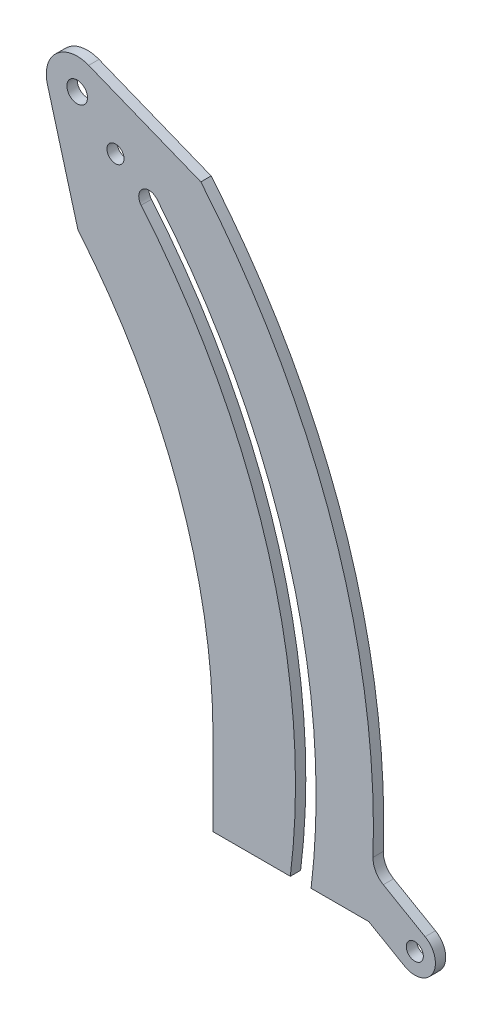
ISO-10303-21;
HEADER;
FILE_DESCRIPTION(('STEP AP214'),'2;1');
FILE_NAME('part.step','',(''),(''),'','','');
FILE_SCHEMA(('AUTOMOTIVE_DESIGN { 1 0 10303 214 1 1 1 1 }'));
ENDSEC;
DATA;
#1=APPLICATION_CONTEXT('core data for automotive mechanical design processes');
#2=APPLICATION_PROTOCOL_DEFINITION('international standard','automotive_design',2000,#1);
#3=PRODUCT_CONTEXT('',#1,'mechanical');
#4=PRODUCT('Part','Part','',(#3));
#5=PRODUCT_RELATED_PRODUCT_CATEGORY('part','',(#4));
#6=PRODUCT_DEFINITION_FORMATION('','',#4);
#7=PRODUCT_DEFINITION_CONTEXT('part definition',#1,'design');
#8=PRODUCT_DEFINITION('design','',#6,#7);
#9=PRODUCT_DEFINITION_SHAPE('','',#8);
#10=(LENGTH_UNIT() NAMED_UNIT(*) SI_UNIT(.MILLI.,.METRE.));
#11=(NAMED_UNIT(*) PLANE_ANGLE_UNIT() SI_UNIT($,.RADIAN.));
#12=(NAMED_UNIT(*) SI_UNIT($,.STERADIAN.) SOLID_ANGLE_UNIT());
#13=UNCERTAINTY_MEASURE_WITH_UNIT(LENGTH_MEASURE(1.E-05),#10,'distance_accuracy_value','');
#14=(GEOMETRIC_REPRESENTATION_CONTEXT(3) GLOBAL_UNCERTAINTY_ASSIGNED_CONTEXT((#13)) GLOBAL_UNIT_ASSIGNED_CONTEXT((#10,
#11,#12)) REPRESENTATION_CONTEXT('',''));
#15=CARTESIAN_POINT('',(0.,0.,0.));
#16=DIRECTION('',(0.,0.,1.));
#17=DIRECTION('',(1.,0.,0.));
#18=AXIS2_PLACEMENT_3D('',#15,#16,#17);
#19=CARTESIAN_POINT('',(0.,0.,3.175));
#20=DIRECTION('',(0.,0.,-1.));
#21=DIRECTION('',(-1.,0.,0.));
#22=AXIS2_PLACEMENT_3D('',#19,#20,#21);
#23=CYLINDRICAL_SURFACE('',#22,203.2);
#24=CARTESIAN_POINT('',(0.,0.,0.));
#25=DIRECTION('',(0.,0.,1.));
#26=DIRECTION('',(1.,0.,0.));
#27=AXIS2_PLACEMENT_3D('',#24,#25,#26);
#28=CIRCLE('',#27,203.2);
#29=CARTESIAN_POINT('',(201.606249903122,-25.4000000000001,0.));
#30=VERTEX_POINT('',#29);
#31=CARTESIAN_POINT('',(155.660230841776,130.614442288305,0.));
#32=VERTEX_POINT('',#31);
#33=EDGE_CURVE('E187',#30,#32,#28,.T.);
#34=ORIENTED_EDGE('',*,*,#33,.T.);
#35=DIRECTION('',(0.,0.,-1.));
#36=VECTOR('',#35,1.);
#37=CARTESIAN_POINT('',(155.660230841776,130.614442288305,3.175));
#38=LINE('',#37,#36);
#39=CARTESIAN_POINT('',(155.660230841776,130.614442288305,3.175));
#40=VERTEX_POINT('',#39);
#41=EDGE_CURVE('E259',#40,#32,#38,.T.);
#42=ORIENTED_EDGE('',*,*,#41,.F.);
#43=CARTESIAN_POINT('',(0.,0.,3.175));
#44=DIRECTION('',(0.,0.,1.));
#45=DIRECTION('',(1.,0.,0.));
#46=AXIS2_PLACEMENT_3D('',#43,#44,#45);
#47=CIRCLE('',#46,203.2);
#48=CARTESIAN_POINT('',(201.606249903122,-25.4000000000001,3.175));
#49=VERTEX_POINT('',#48);
#50=EDGE_CURVE('E190',#49,#40,#47,.T.);
#51=ORIENTED_EDGE('',*,*,#50,.F.);
#52=DIRECTION('',(0.,0.,-1.));
#53=VECTOR('',#52,1.);
#54=CARTESIAN_POINT('',(201.606249903122,-25.4000000000001,3.175));
#55=LINE('',#54,#53);
#56=EDGE_CURVE('E212',#49,#30,#55,.T.);
#57=ORIENTED_EDGE('',*,*,#56,.T.);
#58=EDGE_LOOP('',(#34,#42,#51,#57));
#59=FACE_BOUND('',#58,.T.);
#60=ADVANCED_FACE('F33',(#59),#23,.T.);
#61=CARTESIAN_POINT('',(0.,0.,3.175));
#62=DIRECTION('',(0.,0.,-1.));
#63=DIRECTION('',(-1.,0.,0.));
#64=AXIS2_PLACEMENT_3D('',#61,#62,#63);
#65=CYLINDRICAL_SURFACE('',#64,209.55);
#66=CARTESIAN_POINT('',(0.,0.,0.));
#67=DIRECTION('',(0.,0.,-1.));
#68=DIRECTION('',(1.,0.,0.));
#69=AXIS2_PLACEMENT_3D('',#66,#67,#68);
#70=CIRCLE('',#69,209.55);
#71=CARTESIAN_POINT('',(160.524613055582,134.696143609815,0.));
#72=VERTEX_POINT('',#71);
#73=CARTESIAN_POINT('',(208.004909797822,-25.4,0.));
#74=VERTEX_POINT('',#73);
#75=EDGE_CURVE('E215',#72,#74,#70,.T.);
#76=ORIENTED_EDGE('',*,*,#75,.T.);
#77=DIRECTION('',(0.,0.,-1.));
#78=VECTOR('',#77,1.);
#79=CARTESIAN_POINT('',(208.004909797822,-25.4,3.175));
#80=LINE('',#79,#78);
#81=CARTESIAN_POINT('',(208.004909797822,-25.4,3.175));
#82=VERTEX_POINT('',#81);
#83=EDGE_CURVE('E253',#82,#74,#80,.T.);
#84=ORIENTED_EDGE('',*,*,#83,.F.);
#85=CARTESIAN_POINT('',(0.,0.,3.175));
#86=DIRECTION('',(0.,0.,-1.));
#87=DIRECTION('',(1.,0.,0.));
#88=AXIS2_PLACEMENT_3D('',#85,#86,#87);
#89=CIRCLE('',#88,209.55);
#90=CARTESIAN_POINT('',(160.524613055582,134.696143609815,3.175));
#91=VERTEX_POINT('',#90);
#92=EDGE_CURVE('E193',#91,#82,#89,.T.);
#93=ORIENTED_EDGE('',*,*,#92,.F.);
#94=DIRECTION('',(0.,0.,-1.));
#95=VECTOR('',#94,1.);
#96=CARTESIAN_POINT('',(160.524613055582,134.696143609815,3.175));
#97=LINE('',#96,#95);
#98=EDGE_CURVE('E256',#91,#72,#97,.T.);
#99=ORIENTED_EDGE('',*,*,#98,.T.);
#100=EDGE_LOOP('',(#76,#84,#93,#99));
#101=FACE_BOUND('',#100,.T.);
#102=ADVANCED_FACE('F280',(#101),#65,.F.);
#103=CARTESIAN_POINT('',(208.004909797822,-25.4,3.175));
#104=DIRECTION('',(0.,1.,0.));
#105=DIRECTION('',(-1.,0.,0.));
#106=AXIS2_PLACEMENT_3D('',#103,#104,#105);
#107=PLANE('',#106);
#108=DIRECTION('',(1.,0.,0.));
#109=VECTOR('',#108,1.);
#110=CARTESIAN_POINT('',(208.004909797822,-25.4,0.));
#111=LINE('',#110,#109);
#112=CARTESIAN_POINT('',(225.775729430778,-25.4000000000001,0.));
#113=VERTEX_POINT('',#112);
#114=EDGE_CURVE('E217',#74,#113,#111,.T.);
#115=ORIENTED_EDGE('',*,*,#114,.T.);
#116=DIRECTION('',(0.,0.,-1.));
#117=VECTOR('',#116,1.);
#118=CARTESIAN_POINT('',(225.775729430778,-25.4000000000001,3.175));
#119=LINE('',#118,#117);
#120=CARTESIAN_POINT('',(225.775729430778,-25.4000000000001,3.175));
#121=VERTEX_POINT('',#120);
#122=EDGE_CURVE('E164',#121,#113,#119,.T.);
#123=ORIENTED_EDGE('',*,*,#122,.F.);
#124=DIRECTION('',(1.,0.,0.));
#125=VECTOR('',#124,1.);
#126=CARTESIAN_POINT('',(208.004909797822,-25.4,3.175));
#127=LINE('',#126,#125);
#128=EDGE_CURVE('E196',#82,#121,#127,.T.);
#129=ORIENTED_EDGE('',*,*,#128,.F.);
#130=ORIENTED_EDGE('',*,*,#83,.T.);
#131=EDGE_LOOP('',(#115,#123,#129,#130));
#132=FACE_BOUND('',#131,.T.);
#133=ADVANCED_FACE('F277',(#132),#107,.F.);
#134=CARTESIAN_POINT('',(0.,0.,3.175));
#135=DIRECTION('',(0.,0.,-1.));
#136=DIRECTION('',(-1.,0.,0.));
#137=AXIS2_PLACEMENT_3D('',#134,#135,#136);
#138=CYLINDRICAL_SURFACE('',#137,227.2);
#139=CARTESIAN_POINT('',(0.,0.,3.175));
#140=DIRECTION('',(0.,0.,1.));
#141=DIRECTION('',(1.,0.,0.));
#142=AXIS2_PLACEMENT_3D('',#139,#140,#141);
#143=CIRCLE('',#142,227.2);
#144=CARTESIAN_POINT('',(227.072738032477,-7.60339676948811,3.175));
#145=VERTEX_POINT('',#144);
#146=CARTESIAN_POINT('',(174.045297476632,146.041344920782,3.175));
#147=VERTEX_POINT('',#146);
#148=EDGE_CURVE('E198',#145,#147,#143,.T.);
#149=ORIENTED_EDGE('',*,*,#148,.F.);
#150=DIRECTION('',(0.,0.,-1.));
#151=VECTOR('',#150,1.);
#152=CARTESIAN_POINT('',(227.072738032477,-7.60339676948811,3.175));
#153=LINE('',#152,#151);
#154=CARTESIAN_POINT('',(227.072738032477,-7.60339676948811,0.));
#155=VERTEX_POINT('',#154);
#156=EDGE_CURVE('E48',#145,#155,#153,.T.);
#157=ORIENTED_EDGE('',*,*,#156,.T.);
#158=CARTESIAN_POINT('',(0.,0.,0.));
#159=DIRECTION('',(0.,0.,1.));
#160=DIRECTION('',(1.,0.,0.));
#161=AXIS2_PLACEMENT_3D('',#158,#159,#160);
#162=CIRCLE('',#161,227.2);
#163=CARTESIAN_POINT('',(174.045297476632,146.041344920782,0.));
#164=VERTEX_POINT('',#163);
#165=EDGE_CURVE('E219',#155,#164,#162,.T.);
#166=ORIENTED_EDGE('',*,*,#165,.T.);
#167=DIRECTION('',(0.,0.,-1.));
#168=VECTOR('',#167,1.);
#169=CARTESIAN_POINT('',(174.045297476632,146.041344920782,3.175));
#170=LINE('',#169,#168);
#171=EDGE_CURVE('E249',#147,#164,#170,.T.);
#172=ORIENTED_EDGE('',*,*,#171,.F.);
#173=EDGE_LOOP('',(#149,#157,#166,#172));
#174=FACE_BOUND('',#173,.T.);
#175=ADVANCED_FACE('F336',(#174),#138,.T.);
#176=CARTESIAN_POINT('',(174.045297476632,146.041344920782,3.175));
#177=DIRECTION('',(-0.371233996494278,-0.92853934749524,0.));
#178=DIRECTION('',(0.92853934749524,-0.371233996494278,0.));
#179=AXIS2_PLACEMENT_3D('',#176,#177,#178);
#180=PLANE('',#179);
#181=DIRECTION('',(-0.92853934749524,0.371233996494278,0.));
#182=VECTOR('',#181,1.);
#183=CARTESIAN_POINT('',(174.045297476632,146.041344920782,0.));
#184=LINE('',#183,#182);
#185=CARTESIAN_POINT('',(139.503343028728,159.851365821899,0.));
#186=VERTEX_POINT('',#185);
#187=EDGE_CURVE('E221',#164,#186,#184,.T.);
#188=ORIENTED_EDGE('',*,*,#187,.T.);
#189=DIRECTION('',(0.,0.,-1.));
#190=VECTOR('',#189,1.);
#191=CARTESIAN_POINT('',(139.503343028728,159.851365821899,3.175));
#192=LINE('',#191,#190);
#193=CARTESIAN_POINT('',(139.503343028728,159.851365821899,3.175));
#194=VERTEX_POINT('',#193);
#195=EDGE_CURVE('E246',#194,#186,#192,.T.);
#196=ORIENTED_EDGE('',*,*,#195,.F.);
#197=DIRECTION('',(-0.92853934749524,0.371233996494278,0.));
#198=VECTOR('',#197,1.);
#199=CARTESIAN_POINT('',(174.045297476632,146.041344920782,3.175));
#200=LINE('',#199,#198);
#201=EDGE_CURVE('E200',#147,#194,#200,.T.);
#202=ORIENTED_EDGE('',*,*,#201,.F.);
#203=ORIENTED_EDGE('',*,*,#171,.T.);
#204=EDGE_LOOP('',(#188,#196,#202,#203));
#205=FACE_BOUND('',#204,.T.);
#206=ADVANCED_FACE('F315',(#205),#180,.F.);
#207=CARTESIAN_POINT('',(135.96733921212,151.007028537007,3.175));
#208=DIRECTION('',(0.,0.,-1.));
#209=DIRECTION('',(-1.,0.,0.));
#210=AXIS2_PLACEMENT_3D('',#207,#208,#209);
#211=CYLINDRICAL_SURFACE('',#210,9.52499999999994);
#212=CARTESIAN_POINT('',(135.96733921212,151.007028537007,0.));
#213=DIRECTION('',(0.,0.,1.));
#214=DIRECTION('',(1.,0.,0.));
#215=AXIS2_PLACEMENT_3D('',#212,#213,#214);
#216=CIRCLE('',#215,9.52499999999994);
#217=CARTESIAN_POINT('',(126.784391337904,148.477385609746,0.));
#218=VERTEX_POINT('',#217);
#219=EDGE_CURVE('E223',#186,#218,#216,.T.);
#220=ORIENTED_EDGE('',*,*,#219,.T.);
#221=DIRECTION('',(0.,0.,-1.));
#222=VECTOR('',#221,1.);
#223=CARTESIAN_POINT('',(126.784391337904,148.477385609746,3.175));
#224=LINE('',#223,#222);
#225=CARTESIAN_POINT('',(126.784391337904,148.477385609746,3.175));
#226=VERTEX_POINT('',#225);
#227=EDGE_CURVE('E243',#226,#218,#224,.T.);
#228=ORIENTED_EDGE('',*,*,#227,.F.);
#229=CARTESIAN_POINT('',(135.96733921212,151.007028537007,3.175));
#230=DIRECTION('',(0.,0.,1.));
#231=DIRECTION('',(1.,0.,0.));
#232=AXIS2_PLACEMENT_3D('',#229,#230,#231);
#233=CIRCLE('',#232,9.52499999999994);
#234=EDGE_CURVE('E202',#194,#226,#233,.T.);
#235=ORIENTED_EDGE('',*,*,#234,.F.);
#236=ORIENTED_EDGE('',*,*,#195,.T.);
#237=EDGE_LOOP('',(#220,#228,#235,#236));
#238=FACE_BOUND('',#237,.T.);
#239=ADVANCED_FACE('F311',(#238),#211,.T.);
#240=CARTESIAN_POINT('',(126.784391337904,148.477385609746,3.175));
#241=DIRECTION('',(0.964089015665682,0.265579309948603,0.));
#242=DIRECTION('',(-0.265579309948603,0.964089015665682,0.));
#243=AXIS2_PLACEMENT_3D('',#240,#241,#242);
#244=PLANE('',#243);
#245=DIRECTION('',(0.265579309948603,-0.964089015665682,0.));
#246=VECTOR('',#245,1.);
#247=CARTESIAN_POINT('',(126.784391337904,148.477385609746,0.));
#248=LINE('',#247,#246);
#249=CARTESIAN_POINT('',(136.202701986554,114.287637002267,0.));
#250=VERTEX_POINT('',#249);
#251=EDGE_CURVE('E225',#218,#250,#248,.T.);
#252=ORIENTED_EDGE('',*,*,#251,.T.);
#253=DIRECTION('',(0.,0.,-1.));
#254=VECTOR('',#253,1.);
#255=CARTESIAN_POINT('',(136.202701986554,114.287637002267,3.175));
#256=LINE('',#255,#254);
#257=CARTESIAN_POINT('',(136.202701986554,114.287637002267,3.175));
#258=VERTEX_POINT('',#257);
#259=EDGE_CURVE('E240',#258,#250,#256,.T.);
#260=ORIENTED_EDGE('',*,*,#259,.F.);
#261=DIRECTION('',(0.265579309948603,-0.964089015665682,0.));
#262=VECTOR('',#261,1.);
#263=CARTESIAN_POINT('',(126.784391337904,148.477385609746,3.175));
#264=LINE('',#263,#262);
#265=EDGE_CURVE('E204',#226,#258,#264,.T.);
#266=ORIENTED_EDGE('',*,*,#265,.F.);
#267=ORIENTED_EDGE('',*,*,#227,.T.);
#268=EDGE_LOOP('',(#252,#260,#266,#267));
#269=FACE_BOUND('',#268,.T.);
#270=ADVANCED_FACE('F306',(#269),#244,.F.);
#271=CARTESIAN_POINT('',(0.,0.,3.175));
#272=DIRECTION('',(0.,0.,-1.));
#273=DIRECTION('',(-1.,0.,0.));
#274=AXIS2_PLACEMENT_3D('',#271,#272,#273);
#275=CYLINDRICAL_SURFACE('',#274,177.8);
#276=CARTESIAN_POINT('',(0.,0.,0.));
#277=DIRECTION('',(0.,0.,-1.));
#278=DIRECTION('',(1.,0.,0.));
#279=AXIS2_PLACEMENT_3D('',#276,#277,#278);
#280=CIRCLE('',#279,177.8);
#281=CARTESIAN_POINT('',(177.8,0.,0.));
#282=VERTEX_POINT('',#281);
#283=EDGE_CURVE('E227',#250,#282,#280,.T.);
#284=ORIENTED_EDGE('',*,*,#283,.T.);
#285=DIRECTION('',(0.,0.,-1.));
#286=VECTOR('',#285,1.);
#287=CARTESIAN_POINT('',(177.8,0.,3.175));
#288=LINE('',#287,#286);
#289=CARTESIAN_POINT('',(177.8,0.,3.175));
#290=VERTEX_POINT('',#289);
#291=EDGE_CURVE('E237',#290,#282,#288,.T.);
#292=ORIENTED_EDGE('',*,*,#291,.F.);
#293=CARTESIAN_POINT('',(0.,0.,3.175));
#294=DIRECTION('',(0.,0.,-1.));
#295=DIRECTION('',(1.,0.,0.));
#296=AXIS2_PLACEMENT_3D('',#293,#294,#295);
#297=CIRCLE('',#296,177.8);
#298=EDGE_CURVE('E206',#258,#290,#297,.T.);
#299=ORIENTED_EDGE('',*,*,#298,.F.);
#300=ORIENTED_EDGE('',*,*,#259,.T.);
#301=EDGE_LOOP('',(#284,#292,#299,#300));
#302=FACE_BOUND('',#301,.T.);
#303=ADVANCED_FACE('F300',(#302),#275,.F.);
#304=CARTESIAN_POINT('',(177.8,0.,3.175));
#305=DIRECTION('',(1.,0.,0.));
#306=DIRECTION('',(0.,0.,-1.));
#307=AXIS2_PLACEMENT_3D('',#304,#305,#306);
#308=PLANE('',#307);
#309=DIRECTION('',(0.,-1.,0.));
#310=VECTOR('',#309,1.);
#311=CARTESIAN_POINT('',(177.8,0.,0.));
#312=LINE('',#311,#310);
#313=CARTESIAN_POINT('',(177.8,-25.4,0.));
#314=VERTEX_POINT('',#313);
#315=EDGE_CURVE('E229',#282,#314,#312,.T.);
#316=ORIENTED_EDGE('',*,*,#315,.T.);
#317=DIRECTION('',(0.,0.,-1.));
#318=VECTOR('',#317,1.);
#319=CARTESIAN_POINT('',(177.8,-25.4,3.175));
#320=LINE('',#319,#318);
#321=CARTESIAN_POINT('',(177.8,-25.4,3.175));
#322=VERTEX_POINT('',#321);
#323=EDGE_CURVE('E234',#322,#314,#320,.T.);
#324=ORIENTED_EDGE('',*,*,#323,.F.);
#325=DIRECTION('',(0.,-1.,0.));
#326=VECTOR('',#325,1.);
#327=CARTESIAN_POINT('',(177.8,0.,3.175));
#328=LINE('',#327,#326);
#329=EDGE_CURVE('E208',#290,#322,#328,.T.);
#330=ORIENTED_EDGE('',*,*,#329,.F.);
#331=ORIENTED_EDGE('',*,*,#291,.T.);
#332=EDGE_LOOP('',(#316,#324,#330,#331));
#333=FACE_BOUND('',#332,.T.);
#334=ADVANCED_FACE('F296',(#333),#308,.F.);
#335=CARTESIAN_POINT('',(177.8,-25.4,3.175));
#336=DIRECTION('',(0.,1.,0.));
#337=DIRECTION('',(-1.,0.,0.));
#338=AXIS2_PLACEMENT_3D('',#335,#336,#337);
#339=PLANE('',#338);
#340=DIRECTION('',(1.,0.,0.));
#341=VECTOR('',#340,1.);
#342=CARTESIAN_POINT('',(177.8,-25.4,0.));
#343=LINE('',#342,#341);
#344=EDGE_CURVE('E194',#314,#30,#343,.T.);
#345=ORIENTED_EDGE('',*,*,#344,.T.);
#346=ORIENTED_EDGE('',*,*,#56,.F.);
#347=DIRECTION('',(1.,0.,0.));
#348=VECTOR('',#347,1.);
#349=CARTESIAN_POINT('',(177.8,-25.4,3.175));
#350=LINE('',#349,#348);
#351=EDGE_CURVE('E210',#322,#49,#350,.T.);
#352=ORIENTED_EDGE('',*,*,#351,.F.);
#353=ORIENTED_EDGE('',*,*,#323,.T.);
#354=EDGE_LOOP('',(#345,#346,#352,#353));
#355=FACE_BOUND('',#354,.T.);
#356=ADVANCED_FACE('F292',(#355),#339,.F.);
#357=CARTESIAN_POINT('',(0.,0.,3.175));
#358=DIRECTION('',(0.,0.,1.));
#359=DIRECTION('',(1.,0.,0.));
#360=AXIS2_PLACEMENT_3D('',#357,#358,#359);
#361=PLANE('',#360);
#362=CARTESIAN_POINT('',(147.764763316573,140.38458016106,3.175));
#363=DIRECTION('',(0.,0.,1.));
#364=DIRECTION('',(1.,0.,0.));
#365=AXIS2_PLACEMENT_3D('',#362,#363,#364);
#366=CIRCLE('',#365,2.62889999999999);
#367=CARTESIAN_POINT('',(150.393663316573,140.38458016106,3.175));
#368=VERTEX_POINT('',#367);
#369=EDGE_CURVE('E500',#368,#368,#366,.T.);
#370=ORIENTED_EDGE('',*,*,#369,.F.);
#371=EDGE_LOOP('',(#370));
#372=FACE_BOUND('',#371,.T.);
#373=CARTESIAN_POINT('',(158.092421948679,132.65529294906,3.175));
#374=DIRECTION('',(0.,0.,1.));
#375=DIRECTION('',(1.,0.,0.));
#376=AXIS2_PLACEMENT_3D('',#373,#374,#375);
#377=CIRCLE('',#376,3.175);
#378=EDGE_CURVE('E177',#91,#40,#377,.T.);
#379=ORIENTED_EDGE('',*,*,#378,.F.);
#380=ORIENTED_EDGE('',*,*,#92,.T.);
#381=ORIENTED_EDGE('',*,*,#128,.T.);
#382=DIRECTION('',(0.866025403784439,-0.5,0.));
#383=VECTOR('',#382,1.);
#384=CARTESIAN_POINT('',(225.775729430778,-25.4000000000001,3.175));
#385=LINE('',#384,#383);
#386=CARTESIAN_POINT('',(236.774252058841,-31.7500000000001,3.175));
#387=VERTEX_POINT('',#386);
#388=EDGE_CURVE('E173',#121,#387,#385,.T.);
#389=ORIENTED_EDGE('',*,*,#388,.T.);
#390=CARTESIAN_POINT('',(239.949252058841,-26.2507386859689,3.175));
#391=DIRECTION('',(0.,0.,1.));
#392=DIRECTION('',(1.,0.,0.));
#393=AXIS2_PLACEMENT_3D('',#390,#391,#392);
#394=CIRCLE('',#393,6.34999999999999);
#395=CARTESIAN_POINT('',(243.124252058841,-20.7514773719377,3.175));
#396=VERTEX_POINT('',#395);
#397=EDGE_CURVE('E144',#387,#396,#394,.T.);
#398=ORIENTED_EDGE('',*,*,#397,.T.);
#399=DIRECTION('',(-0.866025403784438,0.500000000000001,0.));
#400=VECTOR('',#399,1.);
#401=CARTESIAN_POINT('',(226.914188256718,-11.3925926722012,3.175));
#402=LINE('',#401,#400);
#403=CARTESIAN_POINT('',(230.244181194916,-13.3151649914693,3.175));
#404=VERTEX_POINT('',#403);
#405=EDGE_CURVE('E165',#396,#404,#402,.T.);
#406=ORIENTED_EDGE('',*,*,#405,.T.);
#407=CARTESIAN_POINT('',(233.419181194916,-7.81590367743815,3.175));
#408=DIRECTION('',(0.,0.,1.));
#409=DIRECTION('',(1.,0.,0.));
#410=AXIS2_PLACEMENT_3D('',#407,#408,#409);
#411=CIRCLE('',#410,6.35);
#412=EDGE_CURVE('E41',#404,#145,#411,.F.);
#413=ORIENTED_EDGE('',*,*,#412,.T.);
#414=ORIENTED_EDGE('',*,*,#148,.T.);
#415=ORIENTED_EDGE('',*,*,#201,.T.);
#416=ORIENTED_EDGE('',*,*,#234,.T.);
#417=ORIENTED_EDGE('',*,*,#265,.T.);
#418=ORIENTED_EDGE('',*,*,#298,.T.);
#419=ORIENTED_EDGE('',*,*,#329,.T.);
#420=ORIENTED_EDGE('',*,*,#351,.T.);
#421=ORIENTED_EDGE('',*,*,#50,.T.);
#422=EDGE_LOOP('',(#379,#380,#381,#389,#398,#406,#413,#414,#415,#416,#417,#418,#419,#420,#421));
#423=FACE_BOUND('',#422,.T.);
#424=CARTESIAN_POINT('',(135.96733921212,151.007028537007,3.175));
#425=DIRECTION('',(0.,0.,1.));
#426=DIRECTION('',(1.,0.,0.));
#427=AXIS2_PLACEMENT_3D('',#424,#425,#426);
#428=CIRCLE('',#427,3.175);
#429=CARTESIAN_POINT('',(139.14233921212,151.007028537007,3.175));
#430=VERTEX_POINT('',#429);
#431=EDGE_CURVE('E182',#430,#430,#428,.T.);
#432=ORIENTED_EDGE('',*,*,#431,.F.);
#433=EDGE_LOOP('',(#432));
#434=FACE_BOUND('',#433,.T.);
#435=CARTESIAN_POINT('',(239.949252058841,-26.2507386859689,3.175));
#436=DIRECTION('',(0.,0.,1.));
#437=DIRECTION('',(1.,0.,0.));
#438=AXIS2_PLACEMENT_3D('',#435,#436,#437);
#439=CIRCLE('',#438,2.62889999999996);
#440=CARTESIAN_POINT('',(242.578152058841,-26.2507386859689,3.175));
#441=VERTEX_POINT('',#440);
#442=EDGE_CURVE('E169',#441,#441,#439,.T.);
#443=ORIENTED_EDGE('',*,*,#442,.F.);
#444=EDGE_LOOP('',(#443));
#445=FACE_BOUND('',#444,.T.);
#446=ADVANCED_FACE('F271',(#372,#423,#434,#445),#361,.T.);
#447=CARTESIAN_POINT('',(0.,0.,0.));
#448=DIRECTION('',(0.,0.,1.));
#449=DIRECTION('',(1.,0.,0.));
#450=AXIS2_PLACEMENT_3D('',#447,#448,#449);
#451=PLANE('',#450);
#452=CARTESIAN_POINT('',(147.764763316573,140.38458016106,0.));
#453=DIRECTION('',(0.,0.,1.));
#454=DIRECTION('',(1.,0.,0.));
#455=AXIS2_PLACEMENT_3D('',#452,#453,#454);
#456=CIRCLE('',#455,2.62889999999999);
#457=CARTESIAN_POINT('',(150.393663316573,140.38458016106,0.));
#458=VERTEX_POINT('',#457);
#459=EDGE_CURVE('E497',#458,#458,#456,.T.);
#460=ORIENTED_EDGE('',*,*,#459,.T.);
#461=EDGE_LOOP('',(#460));
#462=FACE_BOUND('',#461,.T.);
#463=CARTESIAN_POINT('',(135.96733921212,151.007028537007,0.));
#464=DIRECTION('',(0.,0.,1.));
#465=DIRECTION('',(1.,0.,0.));
#466=AXIS2_PLACEMENT_3D('',#463,#464,#465);
#467=CIRCLE('',#466,3.175);
#468=CARTESIAN_POINT('',(139.14233921212,151.007028537007,0.));
#469=VERTEX_POINT('',#468);
#470=EDGE_CURVE('E184',#469,#469,#467,.T.);
#471=ORIENTED_EDGE('',*,*,#470,.T.);
#472=EDGE_LOOP('',(#471));
#473=FACE_BOUND('',#472,.T.);
#474=ORIENTED_EDGE('',*,*,#75,.F.);
#475=CARTESIAN_POINT('',(158.092421948679,132.65529294906,0.));
#476=DIRECTION('',(0.,0.,1.));
#477=DIRECTION('',(1.,0.,0.));
#478=AXIS2_PLACEMENT_3D('',#475,#476,#477);
#479=CIRCLE('',#478,3.175);
#480=EDGE_CURVE('E179',#72,#32,#479,.T.);
#481=ORIENTED_EDGE('',*,*,#480,.T.);
#482=ORIENTED_EDGE('',*,*,#33,.F.);
#483=ORIENTED_EDGE('',*,*,#344,.F.);
#484=ORIENTED_EDGE('',*,*,#315,.F.);
#485=ORIENTED_EDGE('',*,*,#283,.F.);
#486=ORIENTED_EDGE('',*,*,#251,.F.);
#487=ORIENTED_EDGE('',*,*,#219,.F.);
#488=ORIENTED_EDGE('',*,*,#187,.F.);
#489=ORIENTED_EDGE('',*,*,#165,.F.);
#490=CARTESIAN_POINT('',(233.419181194916,-7.81590367743815,0.));
#491=DIRECTION('',(0.,0.,1.));
#492=DIRECTION('',(1.,0.,0.));
#493=AXIS2_PLACEMENT_3D('',#490,#491,#492);
#494=CIRCLE('',#493,6.35);
#495=CARTESIAN_POINT('',(230.244181194916,-13.3151649914693,0.));
#496=VERTEX_POINT('',#495);
#497=EDGE_CURVE('E11',#155,#496,#494,.T.);
#498=ORIENTED_EDGE('',*,*,#497,.T.);
#499=DIRECTION('',(-0.866025403784438,0.500000000000001,0.));
#500=VECTOR('',#499,1.);
#501=CARTESIAN_POINT('',(226.914188256718,-11.3925926722012,0.));
#502=LINE('',#501,#500);
#503=CARTESIAN_POINT('',(243.124252058841,-20.7514773719377,0.));
#504=VERTEX_POINT('',#503);
#505=EDGE_CURVE('E150',#504,#496,#502,.T.);
#506=ORIENTED_EDGE('',*,*,#505,.F.);
#507=CARTESIAN_POINT('',(239.949252058841,-26.2507386859689,0.));
#508=DIRECTION('',(0.,0.,1.));
#509=DIRECTION('',(1.,0.,0.));
#510=AXIS2_PLACEMENT_3D('',#507,#508,#509);
#511=CIRCLE('',#510,6.34999999999999);
#512=CARTESIAN_POINT('',(236.774252058841,-31.7500000000001,0.));
#513=VERTEX_POINT('',#512);
#514=EDGE_CURVE('E141',#513,#504,#511,.T.);
#515=ORIENTED_EDGE('',*,*,#514,.F.);
#516=DIRECTION('',(0.866025403784439,-0.5,0.));
#517=VECTOR('',#516,1.);
#518=CARTESIAN_POINT('',(225.775729430778,-25.4000000000001,0.));
#519=LINE('',#518,#517);
#520=EDGE_CURVE('E158',#113,#513,#519,.T.);
#521=ORIENTED_EDGE('',*,*,#520,.F.);
#522=ORIENTED_EDGE('',*,*,#114,.F.);
#523=EDGE_LOOP('',(#474,#481,#482,#483,#484,#485,#486,#487,#488,#489,#498,#506,#515,#521,#522));
#524=FACE_BOUND('',#523,.T.);
#525=CARTESIAN_POINT('',(239.949252058841,-26.2507386859689,0.));
#526=DIRECTION('',(0.,0.,1.));
#527=DIRECTION('',(1.,0.,0.));
#528=AXIS2_PLACEMENT_3D('',#525,#526,#527);
#529=CIRCLE('',#528,2.62889999999996);
#530=CARTESIAN_POINT('',(242.578152058841,-26.2507386859689,0.));
#531=VERTEX_POINT('',#530);
#532=EDGE_CURVE('E175',#531,#531,#529,.T.);
#533=ORIENTED_EDGE('',*,*,#532,.T.);
#534=EDGE_LOOP('',(#533));
#535=FACE_BOUND('',#534,.T.);
#536=ADVANCED_FACE('F155',(#462,#473,#524,#535),#451,.F.);
#537=CARTESIAN_POINT('',(135.96733921212,151.007028537007,0.));
#538=DIRECTION('',(0.,0.,1.));
#539=DIRECTION('',(1.,0.,0.));
#540=AXIS2_PLACEMENT_3D('',#537,#538,#539);
#541=CYLINDRICAL_SURFACE('',#540,3.175);
#542=ORIENTED_EDGE('',*,*,#470,.F.);
#543=EDGE_LOOP('',(#542));
#544=FACE_BOUND('',#543,.T.);
#545=ORIENTED_EDGE('',*,*,#431,.T.);
#546=EDGE_LOOP('',(#545));
#547=FACE_BOUND('',#546,.T.);
#548=ADVANCED_FACE('F353',(#544,#547),#541,.F.);
#549=CARTESIAN_POINT('',(158.092421948679,132.65529294906,0.));
#550=DIRECTION('',(0.,0.,1.));
#551=DIRECTION('',(1.,0.,0.));
#552=AXIS2_PLACEMENT_3D('',#549,#550,#551);
#553=CYLINDRICAL_SURFACE('',#552,3.175);
#554=ORIENTED_EDGE('',*,*,#480,.F.);
#555=ORIENTED_EDGE('',*,*,#98,.F.);
#556=ORIENTED_EDGE('',*,*,#378,.T.);
#557=ORIENTED_EDGE('',*,*,#41,.T.);
#558=EDGE_LOOP('',(#554,#555,#556,#557));
#559=FACE_BOUND('',#558,.T.);
#560=ADVANCED_FACE('F282',(#559),#553,.F.);
#561=CARTESIAN_POINT('',(226.914188256718,-11.3925926722012,0.));
#562=DIRECTION('',(0.500000000000001,0.866025403784438,0.));
#563=DIRECTION('',(-0.866025403784438,0.500000000000002,0.));
#564=AXIS2_PLACEMENT_3D('',#561,#562,#563);
#565=PLANE('',#564);
#566=ORIENTED_EDGE('',*,*,#505,.T.);
#567=DIRECTION('',(0.,0.,-1.));
#568=VECTOR('',#567,1.);
#569=CARTESIAN_POINT('',(230.244181194916,-13.3151649914693,0.));
#570=LINE('',#569,#568);
#571=EDGE_CURVE('E261',#496,#404,#570,.F.);
#572=ORIENTED_EDGE('',*,*,#571,.T.);
#573=ORIENTED_EDGE('',*,*,#405,.F.);
#574=DIRECTION('',(0.,0.,1.));
#575=VECTOR('',#574,1.);
#576=CARTESIAN_POINT('',(243.124252058841,-20.7514773719377,0.));
#577=LINE('',#576,#575);
#578=EDGE_CURVE('E149',#504,#396,#577,.T.);
#579=ORIENTED_EDGE('',*,*,#578,.F.);
#580=EDGE_LOOP('',(#566,#572,#573,#579));
#581=FACE_BOUND('',#580,.T.);
#582=ADVANCED_FACE('F267',(#581),#565,.T.);
#583=CARTESIAN_POINT('',(239.949252058841,-26.2507386859689,0.));
#584=DIRECTION('',(0.,0.,1.));
#585=DIRECTION('',(1.,0.,0.));
#586=AXIS2_PLACEMENT_3D('',#583,#584,#585);
#587=CYLINDRICAL_SURFACE('',#586,6.34999999999999);
#588=ORIENTED_EDGE('',*,*,#397,.F.);
#589=DIRECTION('',(0.,0.,1.));
#590=VECTOR('',#589,1.);
#591=CARTESIAN_POINT('',(236.774252058841,-31.7500000000001,0.));
#592=LINE('',#591,#590);
#593=EDGE_CURVE('E138',#513,#387,#592,.T.);
#594=ORIENTED_EDGE('',*,*,#593,.F.);
#595=ORIENTED_EDGE('',*,*,#514,.T.);
#596=ORIENTED_EDGE('',*,*,#578,.T.);
#597=EDGE_LOOP('',(#588,#594,#595,#596));
#598=FACE_BOUND('',#597,.T.);
#599=ADVANCED_FACE('F140',(#598),#587,.T.);
#600=CARTESIAN_POINT('',(225.775729430778,-25.4000000000001,0.));
#601=DIRECTION('',(-0.5,-0.866025403784439,0.));
#602=DIRECTION('',(0.866025403784439,-0.5,0.));
#603=AXIS2_PLACEMENT_3D('',#600,#601,#602);
#604=PLANE('',#603);
#605=ORIENTED_EDGE('',*,*,#388,.F.);
#606=ORIENTED_EDGE('',*,*,#122,.T.);
#607=ORIENTED_EDGE('',*,*,#520,.T.);
#608=ORIENTED_EDGE('',*,*,#593,.T.);
#609=EDGE_LOOP('',(#605,#606,#607,#608));
#610=FACE_BOUND('',#609,.T.);
#611=ADVANCED_FACE('F162',(#610),#604,.T.);
#612=CARTESIAN_POINT('',(239.949252058841,-26.2507386859689,0.));
#613=DIRECTION('',(0.,0.,1.));
#614=DIRECTION('',(1.,0.,0.));
#615=AXIS2_PLACEMENT_3D('',#612,#613,#614);
#616=CYLINDRICAL_SURFACE('',#615,2.62889999999996);
#617=ORIENTED_EDGE('',*,*,#532,.F.);
#618=EDGE_LOOP('',(#617));
#619=FACE_BOUND('',#618,.T.);
#620=ORIENTED_EDGE('',*,*,#442,.T.);
#621=EDGE_LOOP('',(#620));
#622=FACE_BOUND('',#621,.T.);
#623=ADVANCED_FACE('F319',(#619,#622),#616,.F.);
#624=CARTESIAN_POINT('',(233.419181194916,-7.81590367743815,3.175));
#625=DIRECTION('',(0.,0.,-1.));
#626=DIRECTION('',(-1.,0.,0.));
#627=AXIS2_PLACEMENT_3D('',#624,#625,#626);
#628=CYLINDRICAL_SURFACE('',#627,6.35);
#629=ORIENTED_EDGE('',*,*,#497,.F.);
#630=ORIENTED_EDGE('',*,*,#156,.F.);
#631=ORIENTED_EDGE('',*,*,#412,.F.);
#632=ORIENTED_EDGE('',*,*,#571,.F.);
#633=EDGE_LOOP('',(#629,#630,#631,#632));
#634=FACE_BOUND('',#633,.T.);
#635=ADVANCED_FACE('F35',(#634),#628,.F.);
#636=CARTESIAN_POINT('',(147.764763316573,140.38458016106,0.));
#637=DIRECTION('',(0.,0.,1.));
#638=DIRECTION('',(1.,0.,0.));
#639=AXIS2_PLACEMENT_3D('',#636,#637,#638);
#640=CYLINDRICAL_SURFACE('',#639,2.62889999999999);
#641=ORIENTED_EDGE('',*,*,#459,.F.);
#642=EDGE_LOOP('',(#641));
#643=FACE_BOUND('',#642,.T.);
#644=ORIENTED_EDGE('',*,*,#369,.T.);
#645=EDGE_LOOP('',(#644));
#646=FACE_BOUND('',#645,.T.);
#647=ADVANCED_FACE('F318',(#643,#646),#640,.F.);
#648=CLOSED_SHELL('',(#60,#102,#133,#175,#206,#239,#270,#303,#334,#356,#446,#536,#548,#560,#582,
#599,#611,#623,#635,#647));
#649=MANIFOLD_SOLID_BREP('B2',#648);
#650=ADVANCED_BREP_SHAPE_REPRESENTATION('',(#18,#649),#14);
#651=SHAPE_DEFINITION_REPRESENTATION(#9,#650);
ENDSEC;
END-ISO-10303-21;
